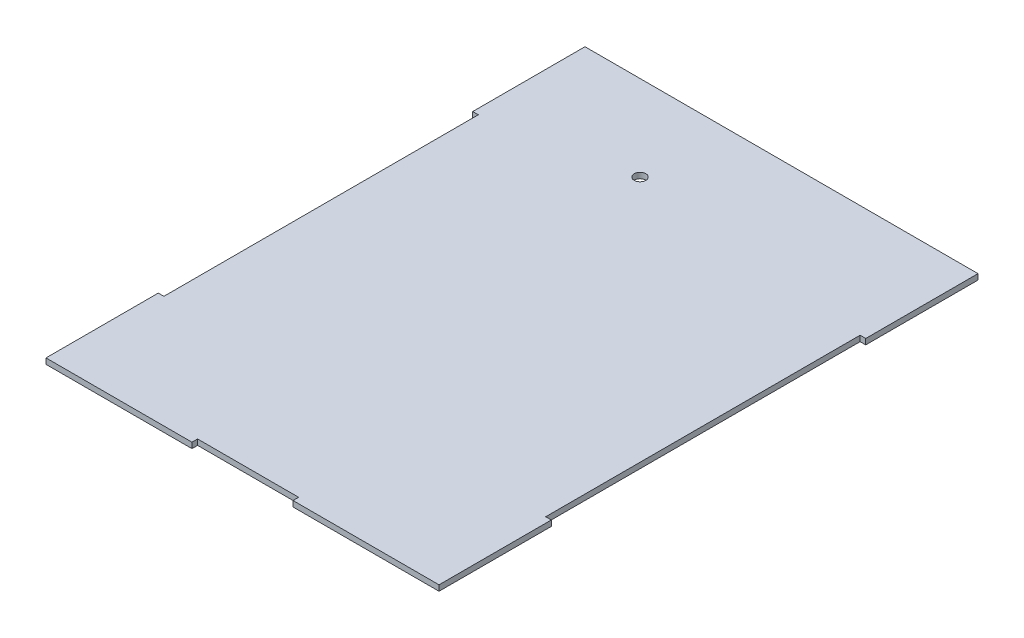
ISO-10303-21;
HEADER;
FILE_DESCRIPTION(('STEP AP214'),'2;1');
FILE_NAME('part.step','',(''),(''),'','','');
FILE_SCHEMA(('AUTOMOTIVE_DESIGN { 1 0 10303 214 1 1 1 1 }'));
ENDSEC;
DATA;
#1=APPLICATION_CONTEXT('core data for automotive mechanical design processes');
#2=APPLICATION_PROTOCOL_DEFINITION('international standard','automotive_design',2000,#1);
#3=PRODUCT_CONTEXT('',#1,'mechanical');
#4=PRODUCT('Part','Part','',(#3));
#5=PRODUCT_RELATED_PRODUCT_CATEGORY('part','',(#4));
#6=PRODUCT_DEFINITION_FORMATION('','',#4);
#7=PRODUCT_DEFINITION_CONTEXT('part definition',#1,'design');
#8=PRODUCT_DEFINITION('design','',#6,#7);
#9=PRODUCT_DEFINITION_SHAPE('','',#8);
#10=(LENGTH_UNIT() NAMED_UNIT(*) SI_UNIT(.MILLI.,.METRE.));
#11=(NAMED_UNIT(*) PLANE_ANGLE_UNIT() SI_UNIT($,.RADIAN.));
#12=(NAMED_UNIT(*) SI_UNIT($,.STERADIAN.) SOLID_ANGLE_UNIT());
#13=UNCERTAINTY_MEASURE_WITH_UNIT(LENGTH_MEASURE(1.E-05),#10,'distance_accuracy_value','');
#14=(GEOMETRIC_REPRESENTATION_CONTEXT(3) GLOBAL_UNCERTAINTY_ASSIGNED_CONTEXT((#13)) GLOBAL_UNIT_ASSIGNED_CONTEXT((#10,
#11,#12)) REPRESENTATION_CONTEXT('',''));
#15=CARTESIAN_POINT('',(0.,0.,0.));
#16=DIRECTION('',(0.,0.,1.));
#17=DIRECTION('',(1.,0.,0.));
#18=AXIS2_PLACEMENT_3D('',#15,#16,#17);
#19=CARTESIAN_POINT('',(0.,6.35,0.));
#20=DIRECTION('',(0.,0.,1.));
#21=DIRECTION('',(1.,0.,0.));
#22=AXIS2_PLACEMENT_3D('',#19,#20,#21);
#23=PLANE('',#22);
#24=DIRECTION('',(0.,-1.,0.));
#25=VECTOR('',#24,1.);
#26=CARTESIAN_POINT('',(-285.75,6.35,0.));
#27=LINE('',#26,#25);
#28=CARTESIAN_POINT('',(-285.75,6.35,0.));
#29=VERTEX_POINT('',#28);
#30=CARTESIAN_POINT('',(-285.75,0.,0.));
#31=VERTEX_POINT('',#30);
#32=EDGE_CURVE('E41',#29,#31,#27,.T.);
#33=ORIENTED_EDGE('',*,*,#32,.F.);
#34=DIRECTION('',(-1.,0.,0.));
#35=VECTOR('',#34,1.);
#36=CARTESIAN_POINT('',(0.,6.35,0.));
#37=LINE('',#36,#35);
#38=CARTESIAN_POINT('',(-450.85,6.35,0.));
#39=VERTEX_POINT('',#38);
#40=EDGE_CURVE('E154',#29,#39,#37,.T.);
#41=ORIENTED_EDGE('',*,*,#40,.T.);
#42=DIRECTION('',(0.,-1.,0.));
#43=VECTOR('',#42,1.);
#44=CARTESIAN_POINT('',(-450.85,954.142010576424,0.));
#45=LINE('',#44,#43);
#46=CARTESIAN_POINT('',(-450.85,0.,0.));
#47=VERTEX_POINT('',#46);
#48=EDGE_CURVE('E257',#39,#47,#45,.T.);
#49=ORIENTED_EDGE('',*,*,#48,.T.);
#50=DIRECTION('',(-1.,0.,0.));
#51=VECTOR('',#50,1.);
#52=CARTESIAN_POINT('',(0.,0.,0.));
#53=LINE('',#52,#51);
#54=EDGE_CURVE('E193',#31,#47,#53,.T.);
#55=ORIENTED_EDGE('',*,*,#54,.F.);
#56=EDGE_LOOP('',(#33,#41,#49,#55));
#57=FACE_BOUND('',#56,.T.);
#58=ADVANCED_FACE('F33',(#57),#23,.T.);
#59=CARTESIAN_POINT('',(0.,6.35,0.));
#60=DIRECTION('',(0.,1.,0.));
#61=DIRECTION('',(0.,0.,1.));
#62=AXIS2_PLACEMENT_3D('',#59,#60,#61);
#63=PLANE('',#62);
#64=CARTESIAN_POINT('',(-292.1,6.35,-513.08));
#65=DIRECTION('',(0.,1.,0.));
#66=DIRECTION('',(0.,0.,1.));
#67=AXIS2_PLACEMENT_3D('',#64,#65,#66);
#68=CIRCLE('',#67,6.60400000000002);
#69=CARTESIAN_POINT('',(-292.1,6.35,-506.476));
#70=VERTEX_POINT('',#69);
#71=EDGE_CURVE('E270',#70,#70,#68,.T.);
#72=ORIENTED_EDGE('',*,*,#71,.F.);
#73=EDGE_LOOP('',(#72));
#74=FACE_BOUND('',#73,.T.);
#75=DIRECTION('',(0.,0.,1.));
#76=VECTOR('',#75,1.);
#77=CARTESIAN_POINT('',(-285.75,6.35,0.));
#78=LINE('',#77,#76);
#79=CARTESIAN_POINT('',(-285.75,6.35,-6.34999999999999));
#80=VERTEX_POINT('',#79);
#81=EDGE_CURVE('E48',#80,#29,#78,.T.);
#82=ORIENTED_EDGE('',*,*,#81,.F.);
#83=DIRECTION('',(-1.,0.,0.));
#84=VECTOR('',#83,1.);
#85=CARTESIAN_POINT('',(0.,6.35,-6.35000000000002));
#86=LINE('',#85,#84);
#87=CARTESIAN_POINT('',(-171.45,6.35,-6.35));
#88=VERTEX_POINT('',#87);
#89=EDGE_CURVE('E52',#88,#80,#86,.T.);
#90=ORIENTED_EDGE('',*,*,#89,.F.);
#91=DIRECTION('',(0.,0.,-1.));
#92=VECTOR('',#91,1.);
#93=CARTESIAN_POINT('',(-171.45,6.35,0.));
#94=LINE('',#93,#92);
#95=CARTESIAN_POINT('',(-171.45,6.34999999999997,0.));
#96=VERTEX_POINT('',#95);
#97=EDGE_CURVE('E156',#96,#88,#94,.T.);
#98=ORIENTED_EDGE('',*,*,#97,.F.);
#99=CARTESIAN_POINT('',(-6.35,6.34999999999997,0.));
#100=VERTEX_POINT('',#99);
#101=EDGE_CURVE('E145',#100,#96,#37,.T.);
#102=ORIENTED_EDGE('',*,*,#101,.F.);
#103=DIRECTION('',(0.,0.,-1.));
#104=VECTOR('',#103,1.);
#105=CARTESIAN_POINT('',(-6.35,6.35,0.));
#106=LINE('',#105,#104);
#107=CARTESIAN_POINT('',(-6.35,6.35000000000019,-127.));
#108=VERTEX_POINT('',#107);
#109=EDGE_CURVE('E230',#100,#108,#106,.T.);
#110=ORIENTED_EDGE('',*,*,#109,.T.);
#111=DIRECTION('',(-1.,0.,0.));
#112=VECTOR('',#111,1.);
#113=CARTESIAN_POINT('',(2.77555756156289E-13,6.35,-127.));
#114=LINE('',#113,#112);
#115=CARTESIAN_POINT('',(-12.7,6.35,-127.));
#116=VERTEX_POINT('',#115);
#117=EDGE_CURVE('E220',#108,#116,#114,.T.);
#118=ORIENTED_EDGE('',*,*,#117,.T.);
#119=DIRECTION('',(0.,0.,-1.));
#120=VECTOR('',#119,1.);
#121=CARTESIAN_POINT('',(-12.7,6.35,0.));
#122=LINE('',#121,#120);
#123=CARTESIAN_POINT('',(-12.7,6.35,-482.6));
#124=VERTEX_POINT('',#123);
#125=EDGE_CURVE('E212',#116,#124,#122,.T.);
#126=ORIENTED_EDGE('',*,*,#125,.T.);
#127=DIRECTION('',(1.,0.,0.));
#128=VECTOR('',#127,1.);
#129=CARTESIAN_POINT('',(2.1094237467878E-12,6.35,-482.6));
#130=LINE('',#129,#128);
#131=CARTESIAN_POINT('',(-6.34999999999999,6.35,-482.6));
#132=VERTEX_POINT('',#131);
#133=EDGE_CURVE('E214',#124,#132,#130,.T.);
#134=ORIENTED_EDGE('',*,*,#133,.T.);
#135=DIRECTION('',(0.,0.,-1.));
#136=VECTOR('',#135,1.);
#137=CARTESIAN_POINT('',(-6.34999999999996,6.35,0.));
#138=LINE('',#137,#136);
#139=CARTESIAN_POINT('',(-6.35,6.34999999999997,-609.6));
#140=VERTEX_POINT('',#139);
#141=EDGE_CURVE('E235',#132,#140,#138,.T.);
#142=ORIENTED_EDGE('',*,*,#141,.T.);
#143=DIRECTION('',(-1.,0.,0.));
#144=VECTOR('',#143,1.);
#145=CARTESIAN_POINT('',(0.,6.35,-609.6));
#146=LINE('',#145,#144);
#147=CARTESIAN_POINT('',(-450.85,6.35,-609.6));
#148=VERTEX_POINT('',#147);
#149=EDGE_CURVE('E192',#140,#148,#146,.T.);
#150=ORIENTED_EDGE('',*,*,#149,.T.);
#151=DIRECTION('',(0.,0.,-1.));
#152=VECTOR('',#151,1.);
#153=CARTESIAN_POINT('',(-450.85,6.35,0.));
#154=LINE('',#153,#152);
#155=CARTESIAN_POINT('',(-450.85,6.35000000000019,-482.6));
#156=VERTEX_POINT('',#155);
#157=EDGE_CURVE('E243',#156,#148,#154,.T.);
#158=ORIENTED_EDGE('',*,*,#157,.F.);
#159=DIRECTION('',(1.,0.,0.));
#160=VECTOR('',#159,1.);
#161=CARTESIAN_POINT('',(-2.10942374678782E-12,6.35,-482.600000000002));
#162=LINE('',#161,#160);
#163=CARTESIAN_POINT('',(-444.5,6.35,-482.6));
#164=VERTEX_POINT('',#163);
#165=EDGE_CURVE('E196',#156,#164,#162,.T.);
#166=ORIENTED_EDGE('',*,*,#165,.T.);
#167=DIRECTION('',(0.,0.,1.));
#168=VECTOR('',#167,1.);
#169=CARTESIAN_POINT('',(-444.5,6.35,0.));
#170=LINE('',#169,#168);
#171=CARTESIAN_POINT('',(-444.5,6.35,-127.));
#172=VERTEX_POINT('',#171);
#173=EDGE_CURVE('E201',#164,#172,#170,.T.);
#174=ORIENTED_EDGE('',*,*,#173,.T.);
#175=DIRECTION('',(-1.,0.,0.));
#176=VECTOR('',#175,1.);
#177=CARTESIAN_POINT('',(0.,6.35,-127.));
#178=LINE('',#177,#176);
#179=CARTESIAN_POINT('',(-450.85,6.35,-127.));
#180=VERTEX_POINT('',#179);
#181=EDGE_CURVE('E203',#172,#180,#178,.T.);
#182=ORIENTED_EDGE('',*,*,#181,.T.);
#183=DIRECTION('',(0.,0.,-1.));
#184=VECTOR('',#183,1.);
#185=CARTESIAN_POINT('',(-450.85,6.35,0.));
#186=LINE('',#185,#184);
#187=EDGE_CURVE('E251',#39,#180,#186,.T.);
#188=ORIENTED_EDGE('',*,*,#187,.F.);
#189=ORIENTED_EDGE('',*,*,#40,.F.);
#190=EDGE_LOOP('',(#82,#90,#98,#102,#110,#118,#126,#134,#142,#150,#158,#166,#174,#182,#188,#189));
#191=FACE_BOUND('',#190,.T.);
#192=ADVANCED_FACE('F157',(#74,#191),#63,.T.);
#193=CARTESIAN_POINT('',(0.,0.,0.));
#194=DIRECTION('',(0.,1.,0.));
#195=DIRECTION('',(0.,0.,1.));
#196=AXIS2_PLACEMENT_3D('',#193,#194,#195);
#197=PLANE('',#196);
#198=CARTESIAN_POINT('',(-292.1,0.,-513.08));
#199=DIRECTION('',(0.,1.,0.));
#200=DIRECTION('',(0.,0.,1.));
#201=AXIS2_PLACEMENT_3D('',#198,#199,#200);
#202=CIRCLE('',#201,6.60400000000002);
#203=CARTESIAN_POINT('',(-292.1,0.,-506.476));
#204=VERTEX_POINT('',#203);
#205=EDGE_CURVE('E269',#204,#204,#202,.T.);
#206=ORIENTED_EDGE('',*,*,#205,.T.);
#207=EDGE_LOOP('',(#206));
#208=FACE_BOUND('',#207,.T.);
#209=DIRECTION('',(-1.,0.,0.));
#210=VECTOR('',#209,1.);
#211=CARTESIAN_POINT('',(0.,0.,-6.35000000000002));
#212=LINE('',#211,#210);
#213=CARTESIAN_POINT('',(-171.45,0.,-6.35));
#214=VERTEX_POINT('',#213);
#215=CARTESIAN_POINT('',(-285.75,0.,-6.34999999999999));
#216=VERTEX_POINT('',#215);
#217=EDGE_CURVE('E11',#214,#216,#212,.T.);
#218=ORIENTED_EDGE('',*,*,#217,.T.);
#219=DIRECTION('',(0.,0.,1.));
#220=VECTOR('',#219,1.);
#221=CARTESIAN_POINT('',(-285.75,0.,0.));
#222=LINE('',#221,#220);
#223=EDGE_CURVE('E161',#216,#31,#222,.T.);
#224=ORIENTED_EDGE('',*,*,#223,.T.);
#225=ORIENTED_EDGE('',*,*,#54,.T.);
#226=DIRECTION('',(0.,0.,-1.));
#227=VECTOR('',#226,1.);
#228=CARTESIAN_POINT('',(-450.85,0.,0.));
#229=LINE('',#228,#227);
#230=CARTESIAN_POINT('',(-450.85,2.22044604925031E-13,-127.));
#231=VERTEX_POINT('',#230);
#232=EDGE_CURVE('E254',#47,#231,#229,.T.);
#233=ORIENTED_EDGE('',*,*,#232,.T.);
#234=DIRECTION('',(-1.,0.,0.));
#235=VECTOR('',#234,1.);
#236=CARTESIAN_POINT('',(0.,0.,-127.));
#237=LINE('',#236,#235);
#238=CARTESIAN_POINT('',(-444.5,0.,-127.));
#239=VERTEX_POINT('',#238);
#240=EDGE_CURVE('E153',#239,#231,#237,.T.);
#241=ORIENTED_EDGE('',*,*,#240,.F.);
#242=DIRECTION('',(0.,0.,1.));
#243=VECTOR('',#242,1.);
#244=CARTESIAN_POINT('',(-444.5,0.,0.));
#245=LINE('',#244,#243);
#246=CARTESIAN_POINT('',(-444.5,0.,-482.6));
#247=VERTEX_POINT('',#246);
#248=EDGE_CURVE('E186',#247,#239,#245,.T.);
#249=ORIENTED_EDGE('',*,*,#248,.F.);
#250=DIRECTION('',(1.,0.,0.));
#251=VECTOR('',#250,1.);
#252=CARTESIAN_POINT('',(-2.10942374678782E-12,0.,-482.600000000002));
#253=LINE('',#252,#251);
#254=CARTESIAN_POINT('',(-450.85,0.,-482.6));
#255=VERTEX_POINT('',#254);
#256=EDGE_CURVE('E184',#255,#247,#253,.T.);
#257=ORIENTED_EDGE('',*,*,#256,.F.);
#258=DIRECTION('',(0.,0.,-1.));
#259=VECTOR('',#258,1.);
#260=CARTESIAN_POINT('',(-450.85,0.,0.));
#261=LINE('',#260,#259);
#262=CARTESIAN_POINT('',(-450.85,0.,-609.6));
#263=VERTEX_POINT('',#262);
#264=EDGE_CURVE('E246',#255,#263,#261,.T.);
#265=ORIENTED_EDGE('',*,*,#264,.T.);
#266=DIRECTION('',(-1.,0.,0.));
#267=VECTOR('',#266,1.);
#268=CARTESIAN_POINT('',(0.,0.,-609.6));
#269=LINE('',#268,#267);
#270=CARTESIAN_POINT('',(-6.35,0.,-609.6));
#271=VERTEX_POINT('',#270);
#272=EDGE_CURVE('E194',#271,#263,#269,.T.);
#273=ORIENTED_EDGE('',*,*,#272,.F.);
#274=DIRECTION('',(0.,0.,-1.));
#275=VECTOR('',#274,1.);
#276=CARTESIAN_POINT('',(-6.34999999999996,0.,0.));
#277=LINE('',#276,#275);
#278=CARTESIAN_POINT('',(-6.34999999999999,2.22044604925031E-13,-482.6));
#279=VERTEX_POINT('',#278);
#280=EDGE_CURVE('E238',#279,#271,#277,.T.);
#281=ORIENTED_EDGE('',*,*,#280,.F.);
#282=DIRECTION('',(1.,0.,0.));
#283=VECTOR('',#282,1.);
#284=CARTESIAN_POINT('',(2.1094237467878E-12,0.,-482.6));
#285=LINE('',#284,#283);
#286=CARTESIAN_POINT('',(-12.7,0.,-482.6));
#287=VERTEX_POINT('',#286);
#288=EDGE_CURVE('E217',#287,#279,#285,.T.);
#289=ORIENTED_EDGE('',*,*,#288,.F.);
#290=DIRECTION('',(0.,0.,-1.));
#291=VECTOR('',#290,1.);
#292=CARTESIAN_POINT('',(-12.7,0.,0.));
#293=LINE('',#292,#291);
#294=CARTESIAN_POINT('',(-12.7,0.,-127.));
#295=VERTEX_POINT('',#294);
#296=EDGE_CURVE('E181',#295,#287,#293,.T.);
#297=ORIENTED_EDGE('',*,*,#296,.F.);
#298=DIRECTION('',(-1.,0.,0.));
#299=VECTOR('',#298,1.);
#300=CARTESIAN_POINT('',(2.77555756156289E-13,0.,-127.));
#301=LINE('',#300,#299);
#302=CARTESIAN_POINT('',(-6.35,0.,-127.));
#303=VERTEX_POINT('',#302);
#304=EDGE_CURVE('E222',#303,#295,#301,.T.);
#305=ORIENTED_EDGE('',*,*,#304,.F.);
#306=DIRECTION('',(0.,0.,-1.));
#307=VECTOR('',#306,1.);
#308=CARTESIAN_POINT('',(-6.35,0.,0.));
#309=LINE('',#308,#307);
#310=CARTESIAN_POINT('',(-6.35,0.,0.));
#311=VERTEX_POINT('',#310);
#312=EDGE_CURVE('E232',#311,#303,#309,.T.);
#313=ORIENTED_EDGE('',*,*,#312,.F.);
#314=CARTESIAN_POINT('',(-171.45,0.,0.));
#315=VERTEX_POINT('',#314);
#316=EDGE_CURVE('E190',#311,#315,#53,.T.);
#317=ORIENTED_EDGE('',*,*,#316,.T.);
#318=DIRECTION('',(0.,0.,-1.));
#319=VECTOR('',#318,1.);
#320=CARTESIAN_POINT('',(-171.45,0.,0.));
#321=LINE('',#320,#319);
#322=EDGE_CURVE('E162',#315,#214,#321,.T.);
#323=ORIENTED_EDGE('',*,*,#322,.T.);
#324=EDGE_LOOP('',(#218,#224,#225,#233,#241,#249,#257,#265,#273,#281,#289,#297,#305,#313,#317,#323));
#325=FACE_BOUND('',#324,.T.);
#326=ADVANCED_FACE('F276',(#208,#325),#197,.F.);
#327=CARTESIAN_POINT('',(0.,6.35,-609.6));
#328=DIRECTION('',(0.,0.,1.));
#329=DIRECTION('',(1.,0.,0.));
#330=AXIS2_PLACEMENT_3D('',#327,#328,#329);
#331=PLANE('',#330);
#332=ORIENTED_EDGE('',*,*,#272,.T.);
#333=DIRECTION('',(0.,-1.,0.));
#334=VECTOR('',#333,1.);
#335=CARTESIAN_POINT('',(-450.85,954.142010576424,-609.6));
#336=LINE('',#335,#334);
#337=EDGE_CURVE('E248',#148,#263,#336,.T.);
#338=ORIENTED_EDGE('',*,*,#337,.F.);
#339=ORIENTED_EDGE('',*,*,#149,.F.);
#340=DIRECTION('',(0.,-1.,0.));
#341=VECTOR('',#340,1.);
#342=CARTESIAN_POINT('',(-6.35,958.883072342504,-609.6));
#343=LINE('',#342,#341);
#344=EDGE_CURVE('E240',#140,#271,#343,.T.);
#345=ORIENTED_EDGE('',*,*,#344,.T.);
#346=EDGE_LOOP('',(#332,#338,#339,#345));
#347=FACE_BOUND('',#346,.T.);
#348=ADVANCED_FACE('F35',(#347),#331,.F.);
#349=CARTESIAN_POINT('',(-12.7,966.820572342504,-482.6));
#350=DIRECTION('',(0.,0.,1.));
#351=DIRECTION('',(1.,0.,0.));
#352=AXIS2_PLACEMENT_3D('',#349,#350,#351);
#353=PLANE('',#352);
#354=ORIENTED_EDGE('',*,*,#288,.T.);
#355=DIRECTION('',(0.,1.,0.));
#356=VECTOR('',#355,1.);
#357=CARTESIAN_POINT('',(-6.34999999999999,966.820572342504,-482.6));
#358=LINE('',#357,#356);
#359=EDGE_CURVE('E175',#279,#132,#358,.T.);
#360=ORIENTED_EDGE('',*,*,#359,.T.);
#361=ORIENTED_EDGE('',*,*,#133,.F.);
#362=DIRECTION('',(0.,-1.,0.));
#363=VECTOR('',#362,1.);
#364=CARTESIAN_POINT('',(-12.7,966.820572342504,-482.6));
#365=LINE('',#364,#363);
#366=EDGE_CURVE('E224',#124,#287,#365,.T.);
#367=ORIENTED_EDGE('',*,*,#366,.T.);
#368=EDGE_LOOP('',(#354,#360,#361,#367));
#369=FACE_BOUND('',#368,.T.);
#370=ADVANCED_FACE('F298',(#369),#353,.T.);
#371=DIRECTION('',(0.,1.,0.));
#372=VECTOR('',#371,1.);
#373=CARTESIAN_POINT('',(-171.45,6.35,0.));
#374=LINE('',#373,#372);
#375=EDGE_CURVE('E149',#315,#96,#374,.T.);
#376=ORIENTED_EDGE('',*,*,#375,.F.);
#377=ORIENTED_EDGE('',*,*,#316,.F.);
#378=DIRECTION('',(0.,-1.,0.));
#379=VECTOR('',#378,1.);
#380=CARTESIAN_POINT('',(-6.35,958.883072342504,0.));
#381=LINE('',#380,#379);
#382=EDGE_CURVE('E151',#100,#311,#381,.T.);
#383=ORIENTED_EDGE('',*,*,#382,.F.);
#384=ORIENTED_EDGE('',*,*,#101,.T.);
#385=EDGE_LOOP('',(#376,#377,#383,#384));
#386=FACE_BOUND('',#385,.T.);
#387=ADVANCED_FACE('F146',(#386),#23,.T.);
#388=CARTESIAN_POINT('',(-12.7,966.820572342504,-127.));
#389=DIRECTION('',(0.,0.,-1.));
#390=DIRECTION('',(-1.,0.,0.));
#391=AXIS2_PLACEMENT_3D('',#388,#389,#390);
#392=PLANE('',#391);
#393=ORIENTED_EDGE('',*,*,#117,.F.);
#394=DIRECTION('',(0.,-1.,0.));
#395=VECTOR('',#394,1.);
#396=CARTESIAN_POINT('',(-6.35,966.820572342504,-127.));
#397=LINE('',#396,#395);
#398=EDGE_CURVE('E178',#108,#303,#397,.T.);
#399=ORIENTED_EDGE('',*,*,#398,.T.);
#400=ORIENTED_EDGE('',*,*,#304,.T.);
#401=DIRECTION('',(0.,-1.,0.));
#402=VECTOR('',#401,1.);
#403=CARTESIAN_POINT('',(-12.7,966.820572342504,-127.));
#404=LINE('',#403,#402);
#405=EDGE_CURVE('E227',#116,#295,#404,.T.);
#406=ORIENTED_EDGE('',*,*,#405,.F.);
#407=EDGE_LOOP('',(#393,#399,#400,#406));
#408=FACE_BOUND('',#407,.T.);
#409=ADVANCED_FACE('F297',(#408),#392,.T.);
#410=CARTESIAN_POINT('',(-444.5,966.820572342504,-482.6));
#411=DIRECTION('',(0.,0.,1.));
#412=DIRECTION('',(1.,0.,0.));
#413=AXIS2_PLACEMENT_3D('',#410,#411,#412);
#414=PLANE('',#413);
#415=DIRECTION('',(0.,1.,0.));
#416=VECTOR('',#415,1.);
#417=CARTESIAN_POINT('',(-450.85,966.820572342504,-482.6));
#418=LINE('',#417,#416);
#419=EDGE_CURVE('E170',#255,#156,#418,.T.);
#420=ORIENTED_EDGE('',*,*,#419,.F.);
#421=ORIENTED_EDGE('',*,*,#256,.T.);
#422=DIRECTION('',(0.,-1.,0.));
#423=VECTOR('',#422,1.);
#424=CARTESIAN_POINT('',(-444.5,966.820572342504,-482.6));
#425=LINE('',#424,#423);
#426=EDGE_CURVE('E206',#164,#247,#425,.T.);
#427=ORIENTED_EDGE('',*,*,#426,.F.);
#428=ORIENTED_EDGE('',*,*,#165,.F.);
#429=EDGE_LOOP('',(#420,#421,#427,#428));
#430=FACE_BOUND('',#429,.T.);
#431=ADVANCED_FACE('F294',(#430),#414,.T.);
#432=CARTESIAN_POINT('',(-444.5,966.820572342504,-482.6));
#433=DIRECTION('',(-1.,0.,0.));
#434=DIRECTION('',(0.,0.,1.));
#435=AXIS2_PLACEMENT_3D('',#432,#433,#434);
#436=PLANE('',#435);
#437=ORIENTED_EDGE('',*,*,#173,.F.);
#438=ORIENTED_EDGE('',*,*,#426,.T.);
#439=ORIENTED_EDGE('',*,*,#248,.T.);
#440=DIRECTION('',(0.,-1.,0.));
#441=VECTOR('',#440,1.);
#442=CARTESIAN_POINT('',(-444.5,966.820572342504,-127.));
#443=LINE('',#442,#441);
#444=EDGE_CURVE('E209',#172,#239,#443,.T.);
#445=ORIENTED_EDGE('',*,*,#444,.F.);
#446=EDGE_LOOP('',(#437,#438,#439,#445));
#447=FACE_BOUND('',#446,.T.);
#448=ADVANCED_FACE('F316',(#447),#436,.T.);
#449=CARTESIAN_POINT('',(-444.5,966.820572342504,-127.));
#450=DIRECTION('',(0.,0.,-1.));
#451=DIRECTION('',(-1.,0.,0.));
#452=AXIS2_PLACEMENT_3D('',#449,#450,#451);
#453=PLANE('',#452);
#454=DIRECTION('',(0.,-1.,0.));
#455=VECTOR('',#454,1.);
#456=CARTESIAN_POINT('',(-450.85,966.820572342504,-127.));
#457=LINE('',#456,#455);
#458=EDGE_CURVE('E166',#180,#231,#457,.T.);
#459=ORIENTED_EDGE('',*,*,#458,.F.);
#460=ORIENTED_EDGE('',*,*,#181,.F.);
#461=ORIENTED_EDGE('',*,*,#444,.T.);
#462=ORIENTED_EDGE('',*,*,#240,.T.);
#463=EDGE_LOOP('',(#459,#460,#461,#462));
#464=FACE_BOUND('',#463,.T.);
#465=ADVANCED_FACE('F314',(#464),#453,.T.);
#466=CARTESIAN_POINT('',(-12.7,966.820572342504,-482.6));
#467=DIRECTION('',(1.,0.,0.));
#468=DIRECTION('',(0.,0.,-1.));
#469=AXIS2_PLACEMENT_3D('',#466,#467,#468);
#470=PLANE('',#469);
#471=ORIENTED_EDGE('',*,*,#125,.F.);
#472=ORIENTED_EDGE('',*,*,#405,.T.);
#473=ORIENTED_EDGE('',*,*,#296,.T.);
#474=ORIENTED_EDGE('',*,*,#366,.F.);
#475=EDGE_LOOP('',(#471,#472,#473,#474));
#476=FACE_BOUND('',#475,.T.);
#477=ADVANCED_FACE('F313',(#476),#470,.T.);
#478=CARTESIAN_POINT('',(-6.35,958.883072342504,-127.));
#479=DIRECTION('',(1.,0.,0.));
#480=DIRECTION('',(0.,0.,-1.));
#481=AXIS2_PLACEMENT_3D('',#478,#479,#480);
#482=PLANE('',#481);
#483=ORIENTED_EDGE('',*,*,#109,.F.);
#484=ORIENTED_EDGE('',*,*,#382,.T.);
#485=ORIENTED_EDGE('',*,*,#312,.T.);
#486=ORIENTED_EDGE('',*,*,#398,.F.);
#487=EDGE_LOOP('',(#483,#484,#485,#486));
#488=FACE_BOUND('',#487,.T.);
#489=ADVANCED_FACE('F349',(#488),#482,.T.);
#490=CARTESIAN_POINT('',(-6.35,958.883072342504,-609.6));
#491=DIRECTION('',(1.,0.,0.));
#492=DIRECTION('',(0.,0.,-1.));
#493=AXIS2_PLACEMENT_3D('',#490,#491,#492);
#494=PLANE('',#493);
#495=ORIENTED_EDGE('',*,*,#141,.F.);
#496=ORIENTED_EDGE('',*,*,#359,.F.);
#497=ORIENTED_EDGE('',*,*,#280,.T.);
#498=ORIENTED_EDGE('',*,*,#344,.F.);
#499=EDGE_LOOP('',(#495,#496,#497,#498));
#500=FACE_BOUND('',#499,.T.);
#501=ADVANCED_FACE('F362',(#500),#494,.T.);
#502=CARTESIAN_POINT('',(-450.85,954.142010576424,-609.6));
#503=DIRECTION('',(1.,0.,0.));
#504=DIRECTION('',(0.,0.,-1.));
#505=AXIS2_PLACEMENT_3D('',#502,#503,#504);
#506=PLANE('',#505);
#507=ORIENTED_EDGE('',*,*,#419,.T.);
#508=ORIENTED_EDGE('',*,*,#157,.T.);
#509=ORIENTED_EDGE('',*,*,#337,.T.);
#510=ORIENTED_EDGE('',*,*,#264,.F.);
#511=EDGE_LOOP('',(#507,#508,#509,#510));
#512=FACE_BOUND('',#511,.T.);
#513=ADVANCED_FACE('F360',(#512),#506,.F.);
#514=CARTESIAN_POINT('',(-450.85,954.142010576424,-127.));
#515=DIRECTION('',(1.,0.,0.));
#516=DIRECTION('',(0.,0.,-1.));
#517=AXIS2_PLACEMENT_3D('',#514,#515,#516);
#518=PLANE('',#517);
#519=ORIENTED_EDGE('',*,*,#48,.F.);
#520=ORIENTED_EDGE('',*,*,#187,.T.);
#521=ORIENTED_EDGE('',*,*,#458,.T.);
#522=ORIENTED_EDGE('',*,*,#232,.F.);
#523=EDGE_LOOP('',(#519,#520,#521,#522));
#524=FACE_BOUND('',#523,.T.);
#525=ADVANCED_FACE('F335',(#524),#518,.F.);
#526=CARTESIAN_POINT('',(-171.45,949.44392137329,-6.35));
#527=DIRECTION('',(0.,0.,-1.));
#528=DIRECTION('',(-1.,0.,0.));
#529=AXIS2_PLACEMENT_3D('',#526,#527,#528);
#530=PLANE('',#529);
#531=DIRECTION('',(0.,-1.,0.));
#532=VECTOR('',#531,1.);
#533=CARTESIAN_POINT('',(-171.45,949.44392137329,-6.35));
#534=LINE('',#533,#532);
#535=EDGE_CURVE('E267',#88,#214,#534,.T.);
#536=ORIENTED_EDGE('',*,*,#535,.F.);
#537=ORIENTED_EDGE('',*,*,#89,.T.);
#538=DIRECTION('',(0.,-1.,0.));
#539=VECTOR('',#538,1.);
#540=CARTESIAN_POINT('',(-285.75,949.44392137329,-6.34999999999999));
#541=LINE('',#540,#539);
#542=EDGE_CURVE('E264',#80,#216,#541,.T.);
#543=ORIENTED_EDGE('',*,*,#542,.T.);
#544=ORIENTED_EDGE('',*,*,#217,.F.);
#545=EDGE_LOOP('',(#536,#537,#543,#544));
#546=FACE_BOUND('',#545,.T.);
#547=ADVANCED_FACE('F344',(#546),#530,.F.);
#548=CARTESIAN_POINT('',(-285.75,949.44392137329,-6.34999999999999));
#549=DIRECTION('',(-1.,0.,0.));
#550=DIRECTION('',(0.,0.,1.));
#551=AXIS2_PLACEMENT_3D('',#548,#549,#550);
#552=PLANE('',#551);
#553=ORIENTED_EDGE('',*,*,#542,.F.);
#554=ORIENTED_EDGE('',*,*,#81,.T.);
#555=ORIENTED_EDGE('',*,*,#32,.T.);
#556=ORIENTED_EDGE('',*,*,#223,.F.);
#557=EDGE_LOOP('',(#553,#554,#555,#556));
#558=FACE_BOUND('',#557,.T.);
#559=ADVANCED_FACE('F340',(#558),#552,.F.);
#560=CARTESIAN_POINT('',(-171.45,949.44392137329,-6.35));
#561=DIRECTION('',(1.,0.,0.));
#562=DIRECTION('',(0.,0.,-1.));
#563=AXIS2_PLACEMENT_3D('',#560,#561,#562);
#564=PLANE('',#563);
#565=ORIENTED_EDGE('',*,*,#375,.T.);
#566=ORIENTED_EDGE('',*,*,#97,.T.);
#567=ORIENTED_EDGE('',*,*,#535,.T.);
#568=ORIENTED_EDGE('',*,*,#322,.F.);
#569=EDGE_LOOP('',(#565,#566,#567,#568));
#570=FACE_BOUND('',#569,.T.);
#571=ADVANCED_FACE('F165',(#570),#564,.F.);
#572=CARTESIAN_POINT('',(-292.1,0.,-513.08));
#573=DIRECTION('',(0.,1.,0.));
#574=DIRECTION('',(0.,0.,1.));
#575=AXIS2_PLACEMENT_3D('',#572,#573,#574);
#576=CYLINDRICAL_SURFACE('',#575,6.60400000000002);
#577=ORIENTED_EDGE('',*,*,#205,.F.);
#578=EDGE_LOOP('',(#577));
#579=FACE_BOUND('',#578,.T.);
#580=ORIENTED_EDGE('',*,*,#71,.T.);
#581=EDGE_LOOP('',(#580));
#582=FACE_BOUND('',#581,.T.);
#583=ADVANCED_FACE('F279',(#579,#582),#576,.F.);
#584=CLOSED_SHELL('',(#58,#192,#326,#348,#370,#387,#409,#431,#448,#465,#477,#489,#501,#513,#525,
#547,#559,#571,#583));
#585=MANIFOLD_SOLID_BREP('B2',#584);
#586=ADVANCED_BREP_SHAPE_REPRESENTATION('',(#18,#585),#14);
#587=SHAPE_DEFINITION_REPRESENTATION(#9,#586);
ENDSEC;
END-ISO-10303-21;
